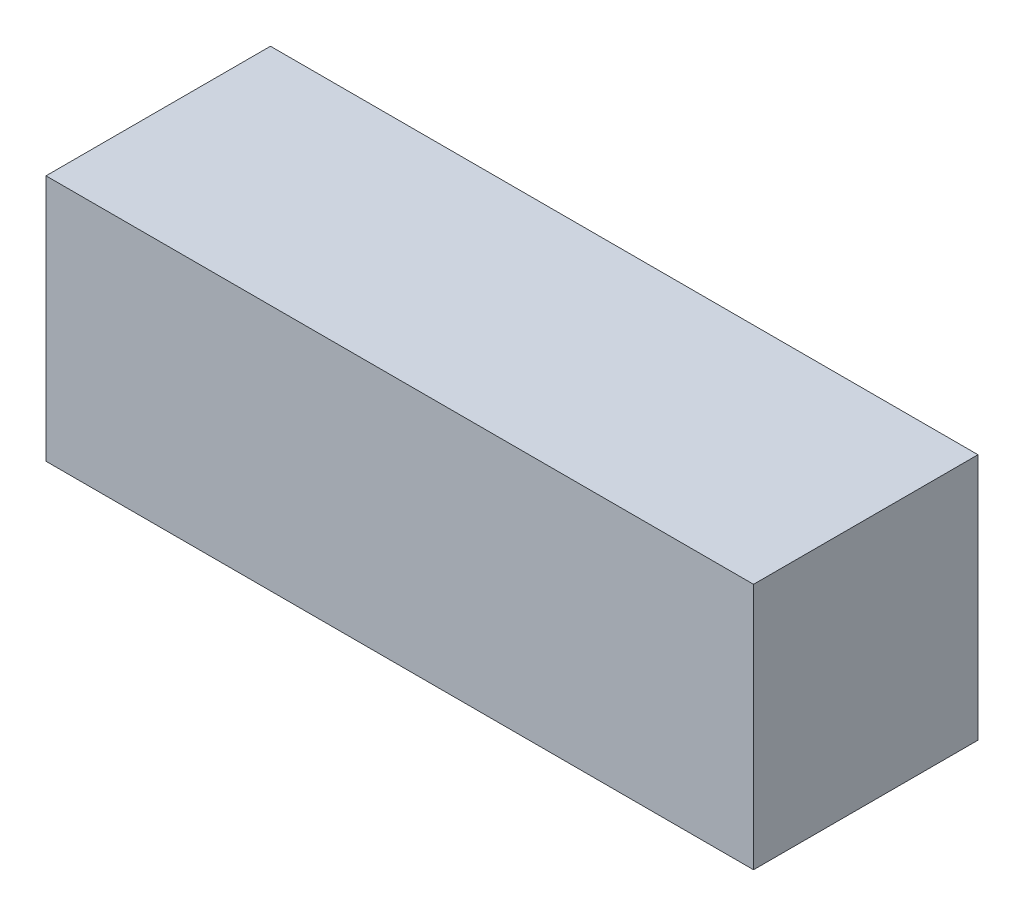
ISO-10303-21;
HEADER;
FILE_DESCRIPTION(('STEP AP214'),'2;1');
FILE_NAME('part.step','',(''),(''),'','','');
FILE_SCHEMA(('AUTOMOTIVE_DESIGN { 1 0 10303 214 1 1 1 1 }'));
ENDSEC;
DATA;
#1=APPLICATION_CONTEXT('core data for automotive mechanical design processes');
#2=APPLICATION_PROTOCOL_DEFINITION('international standard','automotive_design',2000,#1);
#3=PRODUCT_CONTEXT('',#1,'mechanical');
#4=PRODUCT('Part','Part','',(#3));
#5=PRODUCT_RELATED_PRODUCT_CATEGORY('part','',(#4));
#6=PRODUCT_DEFINITION_FORMATION('','',#4);
#7=PRODUCT_DEFINITION_CONTEXT('part definition',#1,'design');
#8=PRODUCT_DEFINITION('design','',#6,#7);
#9=PRODUCT_DEFINITION_SHAPE('','',#8);
#10=(LENGTH_UNIT() NAMED_UNIT(*) SI_UNIT(.MILLI.,.METRE.));
#11=(NAMED_UNIT(*) PLANE_ANGLE_UNIT() SI_UNIT($,.RADIAN.));
#12=(NAMED_UNIT(*) SI_UNIT($,.STERADIAN.) SOLID_ANGLE_UNIT());
#13=UNCERTAINTY_MEASURE_WITH_UNIT(LENGTH_MEASURE(1.E-05),#10,'distance_accuracy_value','');
#14=(GEOMETRIC_REPRESENTATION_CONTEXT(3) GLOBAL_UNCERTAINTY_ASSIGNED_CONTEXT((#13)) GLOBAL_UNIT_ASSIGNED_CONTEXT((#10,
#11,#12)) REPRESENTATION_CONTEXT('',''));
#15=CARTESIAN_POINT('',(0.,0.,0.));
#16=DIRECTION('',(0.,0.,1.));
#17=DIRECTION('',(1.,0.,0.));
#18=AXIS2_PLACEMENT_3D('',#15,#16,#17);
#19=CARTESIAN_POINT('',(26.8224,18.7452,8.509));
#20=DIRECTION('',(-1.,0.,0.));
#21=DIRECTION('',(0.,0.,1.));
#22=AXIS2_PLACEMENT_3D('',#19,#20,#21);
#23=PLANE('',#22);
#24=DIRECTION('',(0.,0.,-1.));
#25=VECTOR('',#24,1.);
#26=CARTESIAN_POINT('',(26.8224,0.,8.509));
#27=LINE('',#26,#25);
#28=CARTESIAN_POINT('',(26.8224,0.,8.509));
#29=VERTEX_POINT('',#28);
#30=CARTESIAN_POINT('',(26.8224,0.,-8.509));
#31=VERTEX_POINT('',#30);
#32=EDGE_CURVE('E99',#29,#31,#27,.T.);
#33=ORIENTED_EDGE('',*,*,#32,.T.);
#34=DIRECTION('',(0.,-1.,0.));
#35=VECTOR('',#34,1.);
#36=CARTESIAN_POINT('',(26.8224,18.7452,-8.509));
#37=LINE('',#36,#35);
#38=CARTESIAN_POINT('',(26.8224,18.7452,-8.509));
#39=VERTEX_POINT('',#38);
#40=EDGE_CURVE('E11',#39,#31,#37,.T.);
#41=ORIENTED_EDGE('',*,*,#40,.F.);
#42=DIRECTION('',(0.,0.,-1.));
#43=VECTOR('',#42,1.);
#44=CARTESIAN_POINT('',(26.8224,18.7452,8.509));
#45=LINE('',#44,#43);
#46=CARTESIAN_POINT('',(26.8224,18.7452,8.509));
#47=VERTEX_POINT('',#46);
#48=EDGE_CURVE('E87',#47,#39,#45,.T.);
#49=ORIENTED_EDGE('',*,*,#48,.F.);
#50=DIRECTION('',(0.,-1.,0.));
#51=VECTOR('',#50,1.);
#52=CARTESIAN_POINT('',(26.8224,18.7452,8.509));
#53=LINE('',#52,#51);
#54=EDGE_CURVE('E95',#47,#29,#53,.T.);
#55=ORIENTED_EDGE('',*,*,#54,.T.);
#56=EDGE_LOOP('',(#33,#41,#49,#55));
#57=FACE_BOUND('',#56,.T.);
#58=ADVANCED_FACE('F36',(#57),#23,.F.);
#59=CARTESIAN_POINT('',(-26.8224,18.7452,-8.509));
#60=DIRECTION('',(0.,0.,1.));
#61=DIRECTION('',(1.,0.,0.));
#62=AXIS2_PLACEMENT_3D('',#59,#60,#61);
#63=PLANE('',#62);
#64=DIRECTION('',(-1.,0.,0.));
#65=VECTOR('',#64,1.);
#66=CARTESIAN_POINT('',(-26.8224,0.,-8.509));
#67=LINE('',#66,#65);
#68=CARTESIAN_POINT('',(-26.8224,0.,-8.509));
#69=VERTEX_POINT('',#68);
#70=EDGE_CURVE('E91',#31,#69,#67,.T.);
#71=ORIENTED_EDGE('',*,*,#70,.T.);
#72=DIRECTION('',(0.,-1.,0.));
#73=VECTOR('',#72,1.);
#74=CARTESIAN_POINT('',(-26.8224,18.7452,-8.509));
#75=LINE('',#74,#73);
#76=CARTESIAN_POINT('',(-26.8224,18.7452,-8.509));
#77=VERTEX_POINT('',#76);
#78=EDGE_CURVE('E44',#77,#69,#75,.T.);
#79=ORIENTED_EDGE('',*,*,#78,.F.);
#80=DIRECTION('',(-1.,0.,0.));
#81=VECTOR('',#80,1.);
#82=CARTESIAN_POINT('',(-26.8224,18.7452,-8.509));
#83=LINE('',#82,#81);
#84=EDGE_CURVE('E82',#39,#77,#83,.T.);
#85=ORIENTED_EDGE('',*,*,#84,.F.);
#86=ORIENTED_EDGE('',*,*,#40,.T.);
#87=EDGE_LOOP('',(#71,#79,#85,#86));
#88=FACE_BOUND('',#87,.T.);
#89=ADVANCED_FACE('F90',(#88),#63,.F.);
#90=CARTESIAN_POINT('',(-26.8224,18.7452,8.509));
#91=DIRECTION('',(1.,0.,0.));
#92=DIRECTION('',(0.,0.,-1.));
#93=AXIS2_PLACEMENT_3D('',#90,#91,#92);
#94=PLANE('',#93);
#95=DIRECTION('',(0.,0.,1.));
#96=VECTOR('',#95,1.);
#97=CARTESIAN_POINT('',(-26.8224,0.,8.509));
#98=LINE('',#97,#96);
#99=CARTESIAN_POINT('',(-26.8224,0.,8.509));
#100=VERTEX_POINT('',#99);
#101=EDGE_CURVE('E69',#69,#100,#98,.T.);
#102=ORIENTED_EDGE('',*,*,#101,.T.);
#103=DIRECTION('',(0.,-1.,0.));
#104=VECTOR('',#103,1.);
#105=CARTESIAN_POINT('',(-26.8224,18.7452,8.509));
#106=LINE('',#105,#104);
#107=CARTESIAN_POINT('',(-26.8224,18.7452,8.509));
#108=VERTEX_POINT('',#107);
#109=EDGE_CURVE('E92',#108,#100,#106,.T.);
#110=ORIENTED_EDGE('',*,*,#109,.F.);
#111=DIRECTION('',(0.,0.,1.));
#112=VECTOR('',#111,1.);
#113=CARTESIAN_POINT('',(-26.8224,18.7452,8.509));
#114=LINE('',#113,#112);
#115=EDGE_CURVE('E85',#77,#108,#114,.T.);
#116=ORIENTED_EDGE('',*,*,#115,.F.);
#117=ORIENTED_EDGE('',*,*,#78,.T.);
#118=EDGE_LOOP('',(#102,#110,#116,#117));
#119=FACE_BOUND('',#118,.T.);
#120=ADVANCED_FACE('F93',(#119),#94,.F.);
#121=CARTESIAN_POINT('',(-26.8224,18.7452,8.509));
#122=DIRECTION('',(0.,0.,-1.));
#123=DIRECTION('',(-1.,0.,0.));
#124=AXIS2_PLACEMENT_3D('',#121,#122,#123);
#125=PLANE('',#124);
#126=DIRECTION('',(1.,0.,0.));
#127=VECTOR('',#126,1.);
#128=CARTESIAN_POINT('',(-26.8224,0.,8.509));
#129=LINE('',#128,#127);
#130=EDGE_CURVE('E75',#100,#29,#129,.T.);
#131=ORIENTED_EDGE('',*,*,#130,.T.);
#132=ORIENTED_EDGE('',*,*,#54,.F.);
#133=DIRECTION('',(1.,0.,0.));
#134=VECTOR('',#133,1.);
#135=CARTESIAN_POINT('',(-26.8224,18.7452,8.509));
#136=LINE('',#135,#134);
#137=EDGE_CURVE('E52',#108,#47,#136,.T.);
#138=ORIENTED_EDGE('',*,*,#137,.F.);
#139=ORIENTED_EDGE('',*,*,#109,.T.);
#140=EDGE_LOOP('',(#131,#132,#138,#139));
#141=FACE_BOUND('',#140,.T.);
#142=ADVANCED_FACE('F106',(#141),#125,.F.);
#143=CARTESIAN_POINT('',(0.,18.7452,0.));
#144=DIRECTION('',(0.,-1.,0.));
#145=DIRECTION('',(0.,0.,-1.));
#146=AXIS2_PLACEMENT_3D('',#143,#144,#145);
#147=PLANE('',#146);
#148=ORIENTED_EDGE('',*,*,#48,.T.);
#149=ORIENTED_EDGE('',*,*,#84,.T.);
#150=ORIENTED_EDGE('',*,*,#115,.T.);
#151=ORIENTED_EDGE('',*,*,#137,.T.);
#152=EDGE_LOOP('',(#148,#149,#150,#151));
#153=FACE_BOUND('',#152,.T.);
#154=ADVANCED_FACE('F83',(#153),#147,.F.);
#155=CARTESIAN_POINT('',(0.,0.,0.));
#156=DIRECTION('',(0.,-1.,0.));
#157=DIRECTION('',(0.,0.,-1.));
#158=AXIS2_PLACEMENT_3D('',#155,#156,#157);
#159=PLANE('',#158);
#160=ORIENTED_EDGE('',*,*,#32,.F.);
#161=ORIENTED_EDGE('',*,*,#130,.F.);
#162=ORIENTED_EDGE('',*,*,#101,.F.);
#163=ORIENTED_EDGE('',*,*,#70,.F.);
#164=EDGE_LOOP('',(#160,#161,#162,#163));
#165=FACE_BOUND('',#164,.T.);
#166=ADVANCED_FACE('F109',(#165),#159,.T.);
#167=CLOSED_SHELL('',(#58,#89,#120,#142,#154,#166));
#168=MANIFOLD_SOLID_BREP('B2',#167);
#169=ADVANCED_BREP_SHAPE_REPRESENTATION('',(#18,#168),#14);
#170=SHAPE_DEFINITION_REPRESENTATION(#9,#169);
ENDSEC;
END-ISO-10303-21;
